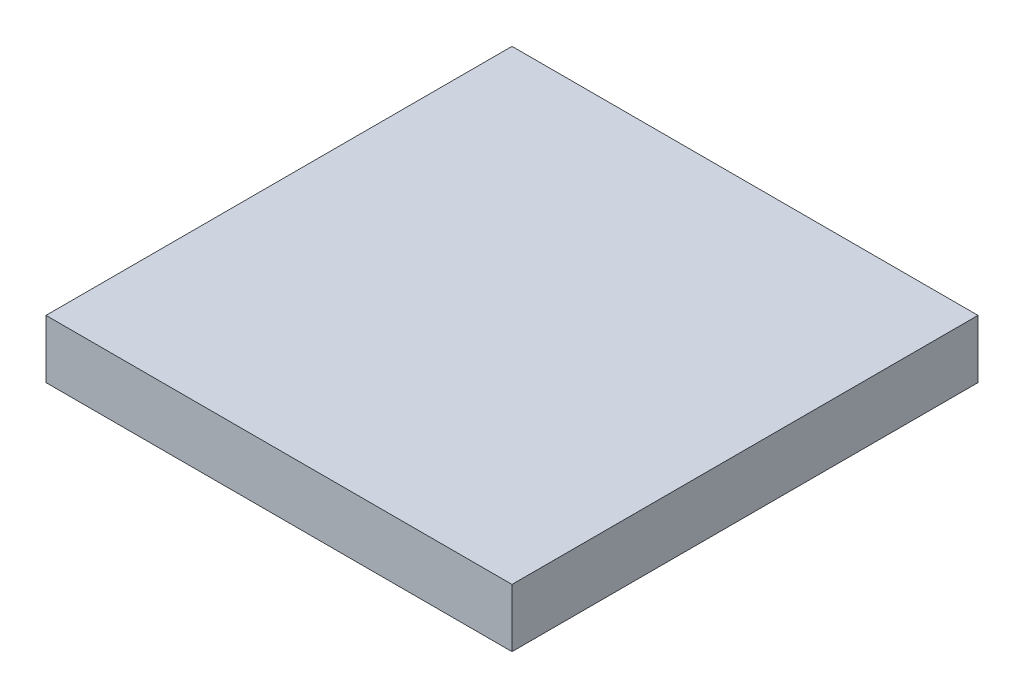
ISO-10303-21;
HEADER;
FILE_DESCRIPTION(('STEP AP214'),'2;1');
FILE_NAME('part.step','',(''),(''),'','','');
FILE_SCHEMA(('AUTOMOTIVE_DESIGN { 1 0 10303 214 1 1 1 1 }'));
ENDSEC;
DATA;
#1=APPLICATION_CONTEXT('core data for automotive mechanical design processes');
#2=APPLICATION_PROTOCOL_DEFINITION('international standard','automotive_design',2000,#1);
#3=PRODUCT_CONTEXT('',#1,'mechanical');
#4=PRODUCT('Part','Part','',(#3));
#5=PRODUCT_RELATED_PRODUCT_CATEGORY('part','',(#4));
#6=PRODUCT_DEFINITION_FORMATION('','',#4);
#7=PRODUCT_DEFINITION_CONTEXT('part definition',#1,'design');
#8=PRODUCT_DEFINITION('design','',#6,#7);
#9=PRODUCT_DEFINITION_SHAPE('','',#8);
#10=(LENGTH_UNIT() NAMED_UNIT(*) SI_UNIT(.MILLI.,.METRE.));
#11=(NAMED_UNIT(*) PLANE_ANGLE_UNIT() SI_UNIT($,.RADIAN.));
#12=(NAMED_UNIT(*) SI_UNIT($,.STERADIAN.) SOLID_ANGLE_UNIT());
#13=UNCERTAINTY_MEASURE_WITH_UNIT(LENGTH_MEASURE(1.E-05),#10,'distance_accuracy_value','');
#14=(GEOMETRIC_REPRESENTATION_CONTEXT(3) GLOBAL_UNCERTAINTY_ASSIGNED_CONTEXT((#13)) GLOBAL_UNIT_ASSIGNED_CONTEXT((#10,
#11,#12)) REPRESENTATION_CONTEXT('',''));
#15=CARTESIAN_POINT('',(0.,0.,0.));
#16=DIRECTION('',(0.,0.,1.));
#17=DIRECTION('',(1.,0.,0.));
#18=AXIS2_PLACEMENT_3D('',#15,#16,#17);
#19=CARTESIAN_POINT('',(0.,1.,-8.));
#20=DIRECTION('',(1.,0.,0.));
#21=DIRECTION('',(0.,0.,-1.));
#22=AXIS2_PLACEMENT_3D('',#19,#20,#21);
#23=PLANE('',#22);
#24=DIRECTION('',(0.,0.,1.));
#25=VECTOR('',#24,1.);
#26=CARTESIAN_POINT('',(0.,0.,-8.));
#27=LINE('',#26,#25);
#28=CARTESIAN_POINT('',(0.,0.,-8.));
#29=VERTEX_POINT('',#28);
#30=CARTESIAN_POINT('',(0.,0.,0.));
#31=VERTEX_POINT('',#30);
#32=EDGE_CURVE('E111',#29,#31,#27,.T.);
#33=ORIENTED_EDGE('',*,*,#32,.T.);
#34=DIRECTION('',(0.,-1.,0.));
#35=VECTOR('',#34,1.);
#36=CARTESIAN_POINT('',(0.,1.,0.));
#37=LINE('',#36,#35);
#38=CARTESIAN_POINT('',(0.,1.,0.));
#39=VERTEX_POINT('',#38);
#40=EDGE_CURVE('E11',#39,#31,#37,.T.);
#41=ORIENTED_EDGE('',*,*,#40,.F.);
#42=DIRECTION('',(0.,0.,1.));
#43=VECTOR('',#42,1.);
#44=CARTESIAN_POINT('',(0.,1.,-8.));
#45=LINE('',#44,#43);
#46=CARTESIAN_POINT('',(0.,1.,-8.));
#47=VERTEX_POINT('',#46);
#48=EDGE_CURVE('E95',#47,#39,#45,.T.);
#49=ORIENTED_EDGE('',*,*,#48,.F.);
#50=DIRECTION('',(0.,-1.,0.));
#51=VECTOR('',#50,1.);
#52=CARTESIAN_POINT('',(0.,1.,-8.));
#53=LINE('',#52,#51);
#54=EDGE_CURVE('E107',#47,#29,#53,.T.);
#55=ORIENTED_EDGE('',*,*,#54,.T.);
#56=EDGE_LOOP('',(#33,#41,#49,#55));
#57=FACE_BOUND('',#56,.T.);
#58=ADVANCED_FACE('F43',(#57),#23,.F.);
#59=CARTESIAN_POINT('',(0.,1.,0.));
#60=DIRECTION('',(0.,0.,-1.));
#61=DIRECTION('',(-1.,0.,0.));
#62=AXIS2_PLACEMENT_3D('',#59,#60,#61);
#63=PLANE('',#62);
#64=DIRECTION('',(1.,0.,0.));
#65=VECTOR('',#64,1.);
#66=CARTESIAN_POINT('',(0.,0.,0.));
#67=LINE('',#66,#65);
#68=CARTESIAN_POINT('',(8.,0.,0.));
#69=VERTEX_POINT('',#68);
#70=EDGE_CURVE('E100',#31,#69,#67,.T.);
#71=ORIENTED_EDGE('',*,*,#70,.T.);
#72=DIRECTION('',(0.,-1.,0.));
#73=VECTOR('',#72,1.);
#74=CARTESIAN_POINT('',(8.,1.,0.));
#75=LINE('',#74,#73);
#76=CARTESIAN_POINT('',(8.,1.,0.));
#77=VERTEX_POINT('',#76);
#78=EDGE_CURVE('E52',#77,#69,#75,.T.);
#79=ORIENTED_EDGE('',*,*,#78,.F.);
#80=DIRECTION('',(1.,0.,0.));
#81=VECTOR('',#80,1.);
#82=CARTESIAN_POINT('',(0.,1.,0.));
#83=LINE('',#82,#81);
#84=EDGE_CURVE('E90',#39,#77,#83,.T.);
#85=ORIENTED_EDGE('',*,*,#84,.F.);
#86=ORIENTED_EDGE('',*,*,#40,.T.);
#87=EDGE_LOOP('',(#71,#79,#85,#86));
#88=FACE_BOUND('',#87,.T.);
#89=ADVANCED_FACE('F99',(#88),#63,.F.);
#90=CARTESIAN_POINT('',(8.,1.,-8.));
#91=DIRECTION('',(-1.,0.,0.));
#92=DIRECTION('',(0.,0.,1.));
#93=AXIS2_PLACEMENT_3D('',#90,#91,#92);
#94=PLANE('',#93);
#95=DIRECTION('',(0.,0.,-1.));
#96=VECTOR('',#95,1.);
#97=CARTESIAN_POINT('',(8.,0.,-8.));
#98=LINE('',#97,#96);
#99=CARTESIAN_POINT('',(8.,0.,-8.));
#100=VERTEX_POINT('',#99);
#101=EDGE_CURVE('E77',#69,#100,#98,.T.);
#102=ORIENTED_EDGE('',*,*,#101,.T.);
#103=DIRECTION('',(0.,-1.,0.));
#104=VECTOR('',#103,1.);
#105=CARTESIAN_POINT('',(8.,1.,-8.));
#106=LINE('',#105,#104);
#107=CARTESIAN_POINT('',(8.,1.,-8.));
#108=VERTEX_POINT('',#107);
#109=EDGE_CURVE('E102',#108,#100,#106,.T.);
#110=ORIENTED_EDGE('',*,*,#109,.F.);
#111=DIRECTION('',(0.,0.,-1.));
#112=VECTOR('',#111,1.);
#113=CARTESIAN_POINT('',(8.,1.,-8.));
#114=LINE('',#113,#112);
#115=EDGE_CURVE('E93',#77,#108,#114,.T.);
#116=ORIENTED_EDGE('',*,*,#115,.F.);
#117=ORIENTED_EDGE('',*,*,#78,.T.);
#118=EDGE_LOOP('',(#102,#110,#116,#117));
#119=FACE_BOUND('',#118,.T.);
#120=ADVANCED_FACE('F103',(#119),#94,.F.);
#121=CARTESIAN_POINT('',(0.,1.,-8.));
#122=DIRECTION('',(0.,0.,1.));
#123=DIRECTION('',(1.,0.,0.));
#124=AXIS2_PLACEMENT_3D('',#121,#122,#123);
#125=PLANE('',#124);
#126=DIRECTION('',(-1.,0.,0.));
#127=VECTOR('',#126,1.);
#128=CARTESIAN_POINT('',(0.,0.,-8.));
#129=LINE('',#128,#127);
#130=EDGE_CURVE('E83',#100,#29,#129,.T.);
#131=ORIENTED_EDGE('',*,*,#130,.T.);
#132=ORIENTED_EDGE('',*,*,#54,.F.);
#133=DIRECTION('',(-1.,0.,0.));
#134=VECTOR('',#133,1.);
#135=CARTESIAN_POINT('',(0.,1.,-8.));
#136=LINE('',#135,#134);
#137=EDGE_CURVE('E60',#108,#47,#136,.T.);
#138=ORIENTED_EDGE('',*,*,#137,.F.);
#139=ORIENTED_EDGE('',*,*,#109,.T.);
#140=EDGE_LOOP('',(#131,#132,#138,#139));
#141=FACE_BOUND('',#140,.T.);
#142=ADVANCED_FACE('F124',(#141),#125,.F.);
#143=CARTESIAN_POINT('',(0.,1.,0.));
#144=DIRECTION('',(0.,1.,0.));
#145=DIRECTION('',(0.,0.,1.));
#146=AXIS2_PLACEMENT_3D('',#143,#144,#145);
#147=PLANE('',#146);
#148=ORIENTED_EDGE('',*,*,#48,.T.);
#149=ORIENTED_EDGE('',*,*,#84,.T.);
#150=ORIENTED_EDGE('',*,*,#115,.T.);
#151=ORIENTED_EDGE('',*,*,#137,.T.);
#152=EDGE_LOOP('',(#148,#149,#150,#151));
#153=FACE_BOUND('',#152,.T.);
#154=ADVANCED_FACE('F91',(#153),#147,.T.);
#155=CARTESIAN_POINT('',(0.,0.,0.));
#156=DIRECTION('',(0.,1.,0.));
#157=DIRECTION('',(0.,0.,1.));
#158=AXIS2_PLACEMENT_3D('',#155,#156,#157);
#159=PLANE('',#158);
#160=ORIENTED_EDGE('',*,*,#32,.F.);
#161=ORIENTED_EDGE('',*,*,#130,.F.);
#162=ORIENTED_EDGE('',*,*,#101,.F.);
#163=ORIENTED_EDGE('',*,*,#70,.F.);
#164=EDGE_LOOP('',(#160,#161,#162,#163));
#165=FACE_BOUND('',#164,.T.);
#166=ADVANCED_FACE('F127',(#165),#159,.F.);
#167=CLOSED_SHELL('',(#58,#89,#120,#142,#154,#166));
#168=MANIFOLD_SOLID_BREP('B2',#167);
#169=ADVANCED_BREP_SHAPE_REPRESENTATION('',(#18,#168),#14);
#170=SHAPE_DEFINITION_REPRESENTATION(#9,#169);
ENDSEC;
END-ISO-10303-21;
